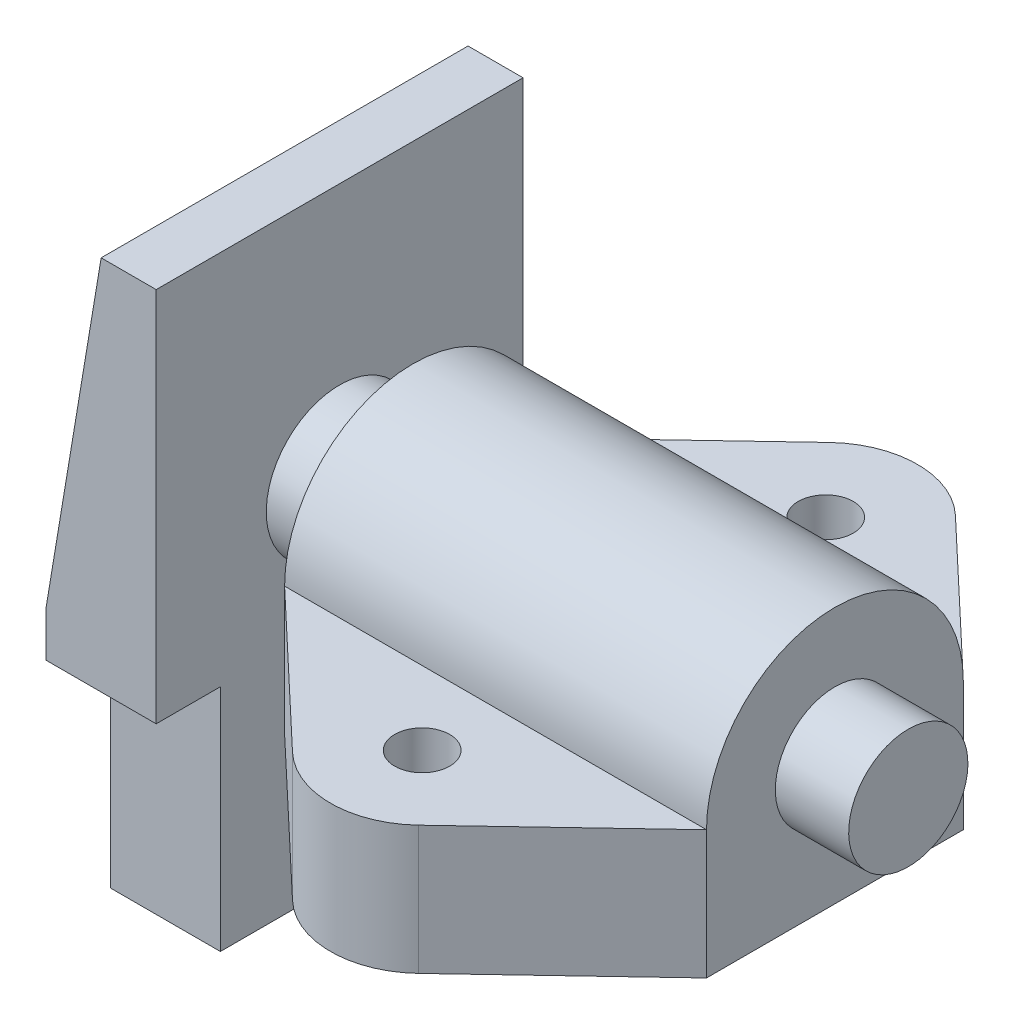
ISO-10303-21;
HEADER;
FILE_DESCRIPTION(('STEP AP214'),'2;1');
FILE_NAME('part.step','',(''),(''),'','','');
FILE_SCHEMA(('AUTOMOTIVE_DESIGN { 1 0 10303 214 1 1 1 1 }'));
ENDSEC;
DATA;
#1=APPLICATION_CONTEXT('core data for automotive mechanical design processes');
#2=APPLICATION_PROTOCOL_DEFINITION('international standard','automotive_design',2000,#1);
#3=PRODUCT_CONTEXT('',#1,'mechanical');
#4=PRODUCT('Part','Part','',(#3));
#5=PRODUCT_RELATED_PRODUCT_CATEGORY('part','',(#4));
#6=PRODUCT_DEFINITION_FORMATION('','',#4);
#7=PRODUCT_DEFINITION_CONTEXT('part definition',#1,'design');
#8=PRODUCT_DEFINITION('design','',#6,#7);
#9=PRODUCT_DEFINITION_SHAPE('','',#8);
#10=(LENGTH_UNIT() NAMED_UNIT(*) SI_UNIT(.MILLI.,.METRE.));
#11=(NAMED_UNIT(*) PLANE_ANGLE_UNIT() SI_UNIT($,.RADIAN.));
#12=(NAMED_UNIT(*) SI_UNIT($,.STERADIAN.) SOLID_ANGLE_UNIT());
#13=UNCERTAINTY_MEASURE_WITH_UNIT(LENGTH_MEASURE(1.E-05),#10,'distance_accuracy_value','');
#14=(GEOMETRIC_REPRESENTATION_CONTEXT(3) GLOBAL_UNCERTAINTY_ASSIGNED_CONTEXT((#13)) GLOBAL_UNIT_ASSIGNED_CONTEXT((#10,
#11,#12)) REPRESENTATION_CONTEXT('',''));
#15=CARTESIAN_POINT('',(0.,0.,0.));
#16=DIRECTION('',(0.,0.,1.));
#17=DIRECTION('',(1.,0.,0.));
#18=AXIS2_PLACEMENT_3D('',#15,#16,#17);
#19=CARTESIAN_POINT('',(-6.,-3.,20.));
#20=DIRECTION('',(1.,0.,0.));
#21=DIRECTION('',(0.,1.,0.));
#22=AXIS2_PLACEMENT_3D('',#19,#20,#21);
#23=PLANE('',#22);
#24=DIRECTION('',(0.,0.,-1.));
#25=VECTOR('',#24,1.);
#26=CARTESIAN_POINT('',(-6.,-8.,-13.));
#27=LINE('',#26,#25);
#28=CARTESIAN_POINT('',(-6.,-8.,-13.));
#29=VERTEX_POINT('',#28);
#30=CARTESIAN_POINT('',(-6.,-8.,-20.));
#31=VERTEX_POINT('',#30);
#32=EDGE_CURVE('E53',#29,#31,#27,.T.);
#33=ORIENTED_EDGE('',*,*,#32,.F.);
#34=DIRECTION('',(0.,-1.,0.));
#35=VECTOR('',#34,1.);
#36=CARTESIAN_POINT('',(-5.99999999999999,-33.,-13.));
#37=LINE('',#36,#35);
#38=CARTESIAN_POINT('',(-5.99999999999999,-33.,-13.));
#39=VERTEX_POINT('',#38);
#40=EDGE_CURVE('E243',#29,#39,#37,.T.);
#41=ORIENTED_EDGE('',*,*,#40,.T.);
#42=DIRECTION('',(0.,0.,-1.));
#43=VECTOR('',#42,1.);
#44=CARTESIAN_POINT('',(-5.99999999999999,-33.,20.));
#45=LINE('',#44,#43);
#46=CARTESIAN_POINT('',(-5.99999999999999,-33.,13.));
#47=VERTEX_POINT('',#46);
#48=EDGE_CURVE('E303',#47,#39,#45,.T.);
#49=ORIENTED_EDGE('',*,*,#48,.F.);
#50=DIRECTION('',(0.,-1.,0.));
#51=VECTOR('',#50,1.);
#52=CARTESIAN_POINT('',(-5.99999999999999,-33.,13.));
#53=LINE('',#52,#51);
#54=CARTESIAN_POINT('',(-6.,-8.,13.));
#55=VERTEX_POINT('',#54);
#56=EDGE_CURVE('E260',#55,#47,#53,.T.);
#57=ORIENTED_EDGE('',*,*,#56,.F.);
#58=DIRECTION('',(0.,0.,1.));
#59=VECTOR('',#58,1.);
#60=CARTESIAN_POINT('',(-6.,-8.,13.));
#61=LINE('',#60,#59);
#62=CARTESIAN_POINT('',(-6.,-8.,20.));
#63=VERTEX_POINT('',#62);
#64=EDGE_CURVE('E270',#55,#63,#61,.T.);
#65=ORIENTED_EDGE('',*,*,#64,.T.);
#66=DIRECTION('',(0.,-1.,0.));
#67=VECTOR('',#66,1.);
#68=CARTESIAN_POINT('',(-6.,-3.,20.));
#69=LINE('',#68,#67);
#70=CARTESIAN_POINT('',(-6.,-3.,20.));
#71=VERTEX_POINT('',#70);
#72=EDGE_CURVE('E278',#71,#63,#69,.T.);
#73=ORIENTED_EDGE('',*,*,#72,.F.);
#74=DIRECTION('',(0.,0.,-1.));
#75=VECTOR('',#74,1.);
#76=CARTESIAN_POINT('',(-6.,-3.,20.));
#77=LINE('',#76,#75);
#78=CARTESIAN_POINT('',(-6.,-3.,-20.));
#79=VERTEX_POINT('',#78);
#80=EDGE_CURVE('E305',#71,#79,#77,.T.);
#81=ORIENTED_EDGE('',*,*,#80,.T.);
#82=DIRECTION('',(0.,-1.,0.));
#83=VECTOR('',#82,1.);
#84=CARTESIAN_POINT('',(-6.,-3.,-20.));
#85=LINE('',#84,#83);
#86=EDGE_CURVE('E289',#79,#31,#85,.T.);
#87=ORIENTED_EDGE('',*,*,#86,.T.);
#88=EDGE_LOOP('',(#33,#41,#49,#57,#65,#73,#81,#87));
#89=FACE_BOUND('',#88,.T.);
#90=ADVANCED_FACE('F37',(#89),#23,.F.);
#91=CARTESIAN_POINT('',(6.,33.,20.));
#92=DIRECTION('',(-1.,0.,0.));
#93=DIRECTION('',(0.,-1.,0.));
#94=AXIS2_PLACEMENT_3D('',#91,#92,#93);
#95=PLANE('',#94);
#96=CARTESIAN_POINT('',(6.,6.,0.));
#97=DIRECTION('',(-1.,0.,0.));
#98=DIRECTION('',(0.,-1.,0.));
#99=AXIS2_PLACEMENT_3D('',#96,#97,#98);
#100=CIRCLE('',#99,8.);
#101=CARTESIAN_POINT('',(6.,-2.,0.));
#102=VERTEX_POINT('',#101);
#103=EDGE_CURVE('E41',#102,#102,#100,.F.);
#104=ORIENTED_EDGE('',*,*,#103,.F.);
#105=EDGE_LOOP('',(#104));
#106=FACE_BOUND('',#105,.T.);
#107=DIRECTION('',(0.,0.,-1.));
#108=VECTOR('',#107,1.);
#109=CARTESIAN_POINT('',(6.00000000000001,-8.,-13.));
#110=LINE('',#109,#108);
#111=CARTESIAN_POINT('',(6.00000000000001,-8.,-13.));
#112=VERTEX_POINT('',#111);
#113=CARTESIAN_POINT('',(6.00000000000001,-8.,-20.));
#114=VERTEX_POINT('',#113);
#115=EDGE_CURVE('E255',#112,#114,#110,.T.);
#116=ORIENTED_EDGE('',*,*,#115,.T.);
#117=DIRECTION('',(0.,1.,0.));
#118=VECTOR('',#117,1.);
#119=CARTESIAN_POINT('',(6.,33.,-20.));
#120=LINE('',#119,#118);
#121=CARTESIAN_POINT('',(6.,33.,-20.));
#122=VERTEX_POINT('',#121);
#123=EDGE_CURVE('E292',#114,#122,#120,.T.);
#124=ORIENTED_EDGE('',*,*,#123,.T.);
#125=DIRECTION('',(0.,0.,-1.));
#126=VECTOR('',#125,1.);
#127=CARTESIAN_POINT('',(6.,33.,20.));
#128=LINE('',#127,#126);
#129=CARTESIAN_POINT('',(6.,33.,20.));
#130=VERTEX_POINT('',#129);
#131=EDGE_CURVE('E297',#130,#122,#128,.T.);
#132=ORIENTED_EDGE('',*,*,#131,.F.);
#133=DIRECTION('',(0.,1.,0.));
#134=VECTOR('',#133,1.);
#135=CARTESIAN_POINT('',(6.,33.,20.));
#136=LINE('',#135,#134);
#137=CARTESIAN_POINT('',(6.,-7.99999999999999,20.));
#138=VERTEX_POINT('',#137);
#139=EDGE_CURVE('E282',#138,#130,#136,.T.);
#140=ORIENTED_EDGE('',*,*,#139,.F.);
#141=DIRECTION('',(0.,0.,1.));
#142=VECTOR('',#141,1.);
#143=CARTESIAN_POINT('',(6.00000000000001,-8.,13.));
#144=LINE('',#143,#142);
#145=CARTESIAN_POINT('',(6.00000000000001,-8.,13.));
#146=VERTEX_POINT('',#145);
#147=EDGE_CURVE('E61',#146,#138,#144,.T.);
#148=ORIENTED_EDGE('',*,*,#147,.F.);
#149=DIRECTION('',(0.,1.,0.));
#150=VECTOR('',#149,1.);
#151=CARTESIAN_POINT('',(6.00000000000001,-8.,13.));
#152=LINE('',#151,#150);
#153=CARTESIAN_POINT('',(6.00000000000001,-33.,13.));
#154=VERTEX_POINT('',#153);
#155=EDGE_CURVE('E264',#154,#146,#152,.T.);
#156=ORIENTED_EDGE('',*,*,#155,.F.);
#157=DIRECTION('',(0.,0.,-1.));
#158=VECTOR('',#157,1.);
#159=CARTESIAN_POINT('',(6.00000000000001,-33.,20.));
#160=LINE('',#159,#158);
#161=CARTESIAN_POINT('',(6.00000000000001,-33.,-13.));
#162=VERTEX_POINT('',#161);
#163=EDGE_CURVE('E300',#154,#162,#160,.T.);
#164=ORIENTED_EDGE('',*,*,#163,.T.);
#165=DIRECTION('',(0.,1.,0.));
#166=VECTOR('',#165,1.);
#167=CARTESIAN_POINT('',(6.00000000000001,-8.,-13.));
#168=LINE('',#167,#166);
#169=EDGE_CURVE('E248',#162,#112,#168,.T.);
#170=ORIENTED_EDGE('',*,*,#169,.T.);
#171=EDGE_LOOP('',(#116,#124,#132,#140,#148,#156,#164,#170));
#172=FACE_BOUND('',#171,.T.);
#173=ADVANCED_FACE('F314',(#106,#172),#95,.F.);
#174=CARTESIAN_POINT('',(0.,0.,-20.));
#175=DIRECTION('',(0.,0.,1.));
#176=DIRECTION('',(1.,0.,0.));
#177=AXIS2_PLACEMENT_3D('',#174,#175,#176);
#178=PLANE('',#177);
#179=DIRECTION('',(-1.,0.,0.));
#180=VECTOR('',#179,1.);
#181=CARTESIAN_POINT('',(-6.,-8.,-20.));
#182=LINE('',#181,#180);
#183=EDGE_CURVE('E242',#114,#31,#182,.T.);
#184=ORIENTED_EDGE('',*,*,#183,.T.);
#185=ORIENTED_EDGE('',*,*,#86,.F.);
#186=DIRECTION('',(-0.164398987305357,-0.986393923832144,0.));
#187=VECTOR('',#186,1.);
#188=CARTESIAN_POINT('',(0.,33.,-20.));
#189=LINE('',#188,#187);
#190=CARTESIAN_POINT('',(0.,33.,-20.));
#191=VERTEX_POINT('',#190);
#192=EDGE_CURVE('E273',#191,#79,#189,.T.);
#193=ORIENTED_EDGE('',*,*,#192,.F.);
#194=DIRECTION('',(-1.,0.,0.));
#195=VECTOR('',#194,1.);
#196=CARTESIAN_POINT('',(0.,33.,-20.));
#197=LINE('',#196,#195);
#198=EDGE_CURVE('E279',#122,#191,#197,.T.);
#199=ORIENTED_EDGE('',*,*,#198,.F.);
#200=ORIENTED_EDGE('',*,*,#123,.F.);
#201=EDGE_LOOP('',(#184,#185,#193,#199,#200));
#202=FACE_BOUND('',#201,.T.);
#203=ADVANCED_FACE('F317',(#202),#178,.F.);
#204=CARTESIAN_POINT('',(0.,33.,20.));
#205=DIRECTION('',(0.986393923832144,-0.164398987305357,0.));
#206=DIRECTION('',(0.164398987305357,0.986393923832144,0.));
#207=AXIS2_PLACEMENT_3D('',#204,#205,#206);
#208=PLANE('',#207);
#209=ORIENTED_EDGE('',*,*,#192,.T.);
#210=ORIENTED_EDGE('',*,*,#80,.F.);
#211=DIRECTION('',(-0.164398987305357,-0.986393923832144,0.));
#212=VECTOR('',#211,1.);
#213=CARTESIAN_POINT('',(0.,33.,20.));
#214=LINE('',#213,#212);
#215=CARTESIAN_POINT('',(0.,33.,20.));
#216=VERTEX_POINT('',#215);
#217=EDGE_CURVE('E275',#216,#71,#214,.T.);
#218=ORIENTED_EDGE('',*,*,#217,.F.);
#219=DIRECTION('',(0.,0.,-1.));
#220=VECTOR('',#219,1.);
#221=CARTESIAN_POINT('',(0.,33.,20.));
#222=LINE('',#221,#220);
#223=EDGE_CURVE('E286',#216,#191,#222,.T.);
#224=ORIENTED_EDGE('',*,*,#223,.T.);
#225=EDGE_LOOP('',(#209,#210,#218,#224));
#226=FACE_BOUND('',#225,.T.);
#227=ADVANCED_FACE('F39',(#226),#208,.F.);
#228=CARTESIAN_POINT('',(-5.99999999999999,-33.,20.));
#229=DIRECTION('',(0.,1.,0.));
#230=DIRECTION('',(0.,0.,1.));
#231=AXIS2_PLACEMENT_3D('',#228,#229,#230);
#232=PLANE('',#231);
#233=ORIENTED_EDGE('',*,*,#48,.T.);
#234=DIRECTION('',(1.,0.,0.));
#235=VECTOR('',#234,1.);
#236=CARTESIAN_POINT('',(6.00000000000001,-33.,-13.));
#237=LINE('',#236,#235);
#238=EDGE_CURVE('E251',#39,#162,#237,.T.);
#239=ORIENTED_EDGE('',*,*,#238,.T.);
#240=ORIENTED_EDGE('',*,*,#163,.F.);
#241=DIRECTION('',(1.,0.,0.));
#242=VECTOR('',#241,1.);
#243=CARTESIAN_POINT('',(6.00000000000001,-33.,13.));
#244=LINE('',#243,#242);
#245=EDGE_CURVE('E262',#47,#154,#244,.T.);
#246=ORIENTED_EDGE('',*,*,#245,.F.);
#247=EDGE_LOOP('',(#233,#239,#240,#246));
#248=FACE_BOUND('',#247,.T.);
#249=ADVANCED_FACE('F339',(#248),#232,.F.);
#250=CARTESIAN_POINT('',(0.,33.,20.));
#251=DIRECTION('',(0.,-1.,0.));
#252=DIRECTION('',(0.,0.,-1.));
#253=AXIS2_PLACEMENT_3D('',#250,#251,#252);
#254=PLANE('',#253);
#255=ORIENTED_EDGE('',*,*,#198,.T.);
#256=ORIENTED_EDGE('',*,*,#223,.F.);
#257=DIRECTION('',(-1.,0.,0.));
#258=VECTOR('',#257,1.);
#259=CARTESIAN_POINT('',(0.,33.,20.));
#260=LINE('',#259,#258);
#261=EDGE_CURVE('E284',#130,#216,#260,.T.);
#262=ORIENTED_EDGE('',*,*,#261,.F.);
#263=ORIENTED_EDGE('',*,*,#131,.T.);
#264=EDGE_LOOP('',(#255,#256,#262,#263));
#265=FACE_BOUND('',#264,.T.);
#266=ADVANCED_FACE('F327',(#265),#254,.F.);
#267=CARTESIAN_POINT('',(0.,0.,20.));
#268=DIRECTION('',(0.,0.,1.));
#269=DIRECTION('',(1.,0.,0.));
#270=AXIS2_PLACEMENT_3D('',#267,#268,#269);
#271=PLANE('',#270);
#272=DIRECTION('',(-1.,0.,0.));
#273=VECTOR('',#272,1.);
#274=CARTESIAN_POINT('',(-6.,-8.,20.));
#275=LINE('',#274,#273);
#276=EDGE_CURVE('E258',#138,#63,#275,.T.);
#277=ORIENTED_EDGE('',*,*,#276,.F.);
#278=ORIENTED_EDGE('',*,*,#139,.T.);
#279=ORIENTED_EDGE('',*,*,#261,.T.);
#280=ORIENTED_EDGE('',*,*,#217,.T.);
#281=ORIENTED_EDGE('',*,*,#72,.T.);
#282=EDGE_LOOP('',(#277,#278,#279,#280,#281));
#283=FACE_BOUND('',#282,.T.);
#284=ADVANCED_FACE('F332',(#283),#271,.T.);
#285=CARTESIAN_POINT('',(-6.,-8.,13.));
#286=DIRECTION('',(0.,1.,0.));
#287=DIRECTION('',(0.,0.,1.));
#288=AXIS2_PLACEMENT_3D('',#285,#286,#287);
#289=PLANE('',#288);
#290=ORIENTED_EDGE('',*,*,#276,.T.);
#291=ORIENTED_EDGE('',*,*,#64,.F.);
#292=DIRECTION('',(-1.,0.,0.));
#293=VECTOR('',#292,1.);
#294=CARTESIAN_POINT('',(-6.,-8.,13.));
#295=LINE('',#294,#293);
#296=EDGE_CURVE('E266',#146,#55,#295,.T.);
#297=ORIENTED_EDGE('',*,*,#296,.F.);
#298=ORIENTED_EDGE('',*,*,#147,.T.);
#299=EDGE_LOOP('',(#290,#291,#297,#298));
#300=FACE_BOUND('',#299,.T.);
#301=ADVANCED_FACE('F346',(#300),#289,.F.);
#302=CARTESIAN_POINT('',(0.,0.,13.));
#303=DIRECTION('',(0.,0.,-1.));
#304=DIRECTION('',(-1.,0.,0.));
#305=AXIS2_PLACEMENT_3D('',#302,#303,#304);
#306=PLANE('',#305);
#307=ORIENTED_EDGE('',*,*,#56,.T.);
#308=ORIENTED_EDGE('',*,*,#245,.T.);
#309=ORIENTED_EDGE('',*,*,#155,.T.);
#310=ORIENTED_EDGE('',*,*,#296,.T.);
#311=EDGE_LOOP('',(#307,#308,#309,#310));
#312=FACE_BOUND('',#311,.T.);
#313=ADVANCED_FACE('F345',(#312),#306,.F.);
#314=CARTESIAN_POINT('',(-6.,-8.,-13.));
#315=DIRECTION('',(0.,-1.,0.));
#316=DIRECTION('',(0.,0.,-1.));
#317=AXIS2_PLACEMENT_3D('',#314,#315,#316);
#318=PLANE('',#317);
#319=ORIENTED_EDGE('',*,*,#183,.F.);
#320=ORIENTED_EDGE('',*,*,#115,.F.);
#321=DIRECTION('',(-1.,0.,0.));
#322=VECTOR('',#321,1.);
#323=CARTESIAN_POINT('',(-6.,-8.,-13.));
#324=LINE('',#323,#322);
#325=EDGE_CURVE('E246',#112,#29,#324,.T.);
#326=ORIENTED_EDGE('',*,*,#325,.T.);
#327=ORIENTED_EDGE('',*,*,#32,.T.);
#328=EDGE_LOOP('',(#319,#320,#326,#327));
#329=FACE_BOUND('',#328,.T.);
#330=ADVANCED_FACE('F353',(#329),#318,.T.);
#331=CARTESIAN_POINT('',(0.,0.,-13.));
#332=DIRECTION('',(0.,0.,1.));
#333=DIRECTION('',(-1.,0.,0.));
#334=AXIS2_PLACEMENT_3D('',#331,#332,#333);
#335=PLANE('',#334);
#336=ORIENTED_EDGE('',*,*,#40,.F.);
#337=ORIENTED_EDGE('',*,*,#325,.F.);
#338=ORIENTED_EDGE('',*,*,#169,.F.);
#339=ORIENTED_EDGE('',*,*,#238,.F.);
#340=EDGE_LOOP('',(#336,#337,#338,#339));
#341=FACE_BOUND('',#340,.T.);
#342=ADVANCED_FACE('F343',(#341),#335,.F.);
#343=CARTESIAN_POINT('',(14.,6.00000000000001,0.));
#344=DIRECTION('',(-1.,0.,0.));
#345=DIRECTION('',(0.,-1.,0.));
#346=AXIS2_PLACEMENT_3D('',#343,#344,#345);
#347=CYLINDRICAL_SURFACE('',#346,8.);
#348=CARTESIAN_POINT('',(14.,6.00000000000001,0.));
#349=DIRECTION('',(1.,0.,0.));
#350=DIRECTION('',(0.,1.,0.));
#351=AXIS2_PLACEMENT_3D('',#348,#349,#350);
#352=CIRCLE('',#351,8.);
#353=CARTESIAN_POINT('',(14.,14.,0.));
#354=VERTEX_POINT('',#353);
#355=EDGE_CURVE('E239',#354,#354,#352,.T.);
#356=ORIENTED_EDGE('',*,*,#355,.F.);
#357=EDGE_LOOP('',(#356));
#358=FACE_BOUND('',#357,.T.);
#359=ORIENTED_EDGE('',*,*,#103,.T.);
#360=EDGE_LOOP('',(#359));
#361=FACE_BOUND('',#360,.T.);
#362=ADVANCED_FACE('F312',(#358,#361),#347,.T.);
#363=CARTESIAN_POINT('',(60.,6.00000000000001,0.));
#364=DIRECTION('',(-1.,0.,0.));
#365=DIRECTION('',(0.,-1.,0.));
#366=AXIS2_PLACEMENT_3D('',#363,#364,#365);
#367=CYLINDRICAL_SURFACE('',#366,14.);
#368=CARTESIAN_POINT('',(14.,6.00000000000001,0.));
#369=DIRECTION('',(1.,0.,0.));
#370=DIRECTION('',(0.,1.,0.));
#371=AXIS2_PLACEMENT_3D('',#368,#369,#370);
#372=CIRCLE('',#371,14.);
#373=CARTESIAN_POINT('',(14.,6.,-14.));
#374=VERTEX_POINT('',#373);
#375=CARTESIAN_POINT('',(14.,6.00000000000001,14.));
#376=VERTEX_POINT('',#375);
#377=EDGE_CURVE('E214',#374,#376,#372,.T.);
#378=ORIENTED_EDGE('',*,*,#377,.T.);
#379=DIRECTION('',(-1.,0.,0.));
#380=VECTOR('',#379,1.);
#381=CARTESIAN_POINT('',(60.,6.00000000000001,14.));
#382=LINE('',#381,#380);
#383=CARTESIAN_POINT('',(60.,6.00000000000001,14.));
#384=VERTEX_POINT('',#383);
#385=EDGE_CURVE('E236',#384,#376,#382,.T.);
#386=ORIENTED_EDGE('',*,*,#385,.F.);
#387=CARTESIAN_POINT('',(60.,6.00000000000001,0.));
#388=DIRECTION('',(1.,0.,0.));
#389=DIRECTION('',(0.,1.,0.));
#390=AXIS2_PLACEMENT_3D('',#387,#388,#389);
#391=CIRCLE('',#390,14.);
#392=CARTESIAN_POINT('',(60.,6.00000000000001,-14.));
#393=VERTEX_POINT('',#392);
#394=EDGE_CURVE('E216',#393,#384,#391,.T.);
#395=ORIENTED_EDGE('',*,*,#394,.F.);
#396=DIRECTION('',(-1.,0.,0.));
#397=VECTOR('',#396,1.);
#398=CARTESIAN_POINT('',(60.,6.00000000000001,-14.));
#399=LINE('',#398,#397);
#400=EDGE_CURVE('E224',#393,#374,#399,.T.);
#401=ORIENTED_EDGE('',*,*,#400,.T.);
#402=EDGE_LOOP('',(#378,#386,#395,#401));
#403=FACE_BOUND('',#402,.T.);
#404=ADVANCED_FACE('F430',(#403),#367,.T.);
#405=CARTESIAN_POINT('',(60.,-7.99999999999999,14.));
#406=DIRECTION('',(0.,1.,0.));
#407=DIRECTION('',(-1.,0.,0.));
#408=AXIS2_PLACEMENT_3D('',#405,#406,#407);
#409=PLANE('',#408);
#410=CARTESIAN_POINT('',(37.,-7.99999999999999,-22.));
#411=DIRECTION('',(0.,1.,0.));
#412=DIRECTION('',(-1.,0.,0.));
#413=AXIS2_PLACEMENT_3D('',#410,#411,#412);
#414=CIRCLE('',#413,3.);
#415=CARTESIAN_POINT('',(34.,-7.99999999999999,-22.));
#416=VERTEX_POINT('',#415);
#417=EDGE_CURVE('E650',#416,#416,#414,.F.);
#418=ORIENTED_EDGE('',*,*,#417,.F.);
#419=EDGE_LOOP('',(#418));
#420=FACE_BOUND('',#419,.T.);
#421=CARTESIAN_POINT('',(37.,-7.99999999999999,22.));
#422=DIRECTION('',(0.,1.,0.));
#423=DIRECTION('',(-1.,0.,0.));
#424=AXIS2_PLACEMENT_3D('',#421,#422,#423);
#425=CIRCLE('',#424,3.);
#426=CARTESIAN_POINT('',(34.,-7.99999999999999,22.));
#427=VERTEX_POINT('',#426);
#428=EDGE_CURVE('E654',#427,#427,#425,.T.);
#429=ORIENTED_EDGE('',*,*,#428,.T.);
#430=EDGE_LOOP('',(#429));
#431=FACE_BOUND('',#430,.T.);
#432=DIRECTION('',(0.,0.,-1.));
#433=VECTOR('',#432,1.);
#434=CARTESIAN_POINT('',(14.,-7.99999999999999,14.));
#435=LINE('',#434,#433);
#436=CARTESIAN_POINT('',(14.,-8.,14.));
#437=VERTEX_POINT('',#436);
#438=CARTESIAN_POINT('',(14.,-7.99999999999999,-14.));
#439=VERTEX_POINT('',#438);
#440=EDGE_CURVE('E230',#437,#439,#435,.T.);
#441=ORIENTED_EDGE('',*,*,#440,.T.);
#442=DIRECTION('',(0.726278037364273,0.,-0.68740105647453));
#443=VECTOR('',#442,1.);
#444=CARTESIAN_POINT('',(14.,-8.,-14.));
#445=LINE('',#444,#443);
#446=CARTESIAN_POINT('',(30.1259894352547,-8.,-29.2627803736427));
#447=VERTEX_POINT('',#446);
#448=EDGE_CURVE('E166',#439,#447,#445,.T.);
#449=ORIENTED_EDGE('',*,*,#448,.T.);
#450=CARTESIAN_POINT('',(37.,-8.,-22.));
#451=DIRECTION('',(0.,-1.,0.));
#452=DIRECTION('',(0.,0.,-1.));
#453=AXIS2_PLACEMENT_3D('',#450,#451,#452);
#454=CIRCLE('',#453,10.);
#455=CARTESIAN_POINT('',(43.8740105647453,-8.,-29.2627803736427));
#456=VERTEX_POINT('',#455);
#457=EDGE_CURVE('E158',#447,#456,#454,.T.);
#458=ORIENTED_EDGE('',*,*,#457,.T.);
#459=DIRECTION('',(0.726278037364273,0.,0.68740105647453));
#460=VECTOR('',#459,1.);
#461=CARTESIAN_POINT('',(60.,-8.,-14.));
#462=LINE('',#461,#460);
#463=CARTESIAN_POINT('',(60.,-7.99999999999999,-14.));
#464=VERTEX_POINT('',#463);
#465=EDGE_CURVE('E163',#456,#464,#462,.T.);
#466=ORIENTED_EDGE('',*,*,#465,.T.);
#467=DIRECTION('',(0.,0.,-1.));
#468=VECTOR('',#467,1.);
#469=CARTESIAN_POINT('',(60.,-7.99999999999999,14.));
#470=LINE('',#469,#468);
#471=CARTESIAN_POINT('',(60.,-7.99999999999999,14.));
#472=VERTEX_POINT('',#471);
#473=EDGE_CURVE('E221',#472,#464,#470,.T.);
#474=ORIENTED_EDGE('',*,*,#473,.F.);
#475=DIRECTION('',(0.726278037364273,0.,-0.68740105647453));
#476=VECTOR('',#475,1.);
#477=CARTESIAN_POINT('',(60.,-8.,14.));
#478=LINE('',#477,#476);
#479=CARTESIAN_POINT('',(43.8740105647453,-8.,29.2627803736427));
#480=VERTEX_POINT('',#479);
#481=EDGE_CURVE('E201',#480,#472,#478,.T.);
#482=ORIENTED_EDGE('',*,*,#481,.F.);
#483=CARTESIAN_POINT('',(37.,-8.,22.));
#484=DIRECTION('',(0.,1.,0.));
#485=DIRECTION('',(0.,0.,1.));
#486=AXIS2_PLACEMENT_3D('',#483,#484,#485);
#487=CIRCLE('',#486,10.);
#488=CARTESIAN_POINT('',(30.1259894352547,-8.,29.2627803736427));
#489=VERTEX_POINT('',#488);
#490=EDGE_CURVE('E197',#489,#480,#487,.T.);
#491=ORIENTED_EDGE('',*,*,#490,.F.);
#492=DIRECTION('',(0.726278037364273,0.,0.68740105647453));
#493=VECTOR('',#492,1.);
#494=CARTESIAN_POINT('',(14.,-8.,14.));
#495=LINE('',#494,#493);
#496=EDGE_CURVE('E194',#437,#489,#495,.T.);
#497=ORIENTED_EDGE('',*,*,#496,.F.);
#498=EDGE_LOOP('',(#441,#449,#458,#466,#474,#482,#491,#497));
#499=FACE_BOUND('',#498,.T.);
#500=ADVANCED_FACE('F160',(#420,#431,#499),#409,.F.);
#501=CARTESIAN_POINT('',(60.,6.00000000000001,0.));
#502=DIRECTION('',(1.,0.,0.));
#503=DIRECTION('',(0.,1.,0.));
#504=AXIS2_PLACEMENT_3D('',#501,#502,#503);
#505=PLANE('',#504);
#506=CARTESIAN_POINT('',(60.,6.00000000000001,0.));
#507=DIRECTION('',(1.,0.,0.));
#508=DIRECTION('',(0.,1.,0.));
#509=AXIS2_PLACEMENT_3D('',#506,#507,#508);
#510=CIRCLE('',#509,6.5);
#511=CARTESIAN_POINT('',(60.,12.5,0.));
#512=VERTEX_POINT('',#511);
#513=EDGE_CURVE('E11',#512,#512,#510,.T.);
#514=ORIENTED_EDGE('',*,*,#513,.F.);
#515=EDGE_LOOP('',(#514));
#516=FACE_BOUND('',#515,.T.);
#517=ORIENTED_EDGE('',*,*,#394,.T.);
#518=DIRECTION('',(0.,-1.,0.));
#519=VECTOR('',#518,1.);
#520=CARTESIAN_POINT('',(60.,6.00000000000001,14.));
#521=LINE('',#520,#519);
#522=EDGE_CURVE('E218',#384,#472,#521,.T.);
#523=ORIENTED_EDGE('',*,*,#522,.T.);
#524=ORIENTED_EDGE('',*,*,#473,.T.);
#525=DIRECTION('',(0.,1.,0.));
#526=VECTOR('',#525,1.);
#527=CARTESIAN_POINT('',(60.,-7.99999999999999,-14.));
#528=LINE('',#527,#526);
#529=EDGE_CURVE('E181',#464,#393,#528,.T.);
#530=ORIENTED_EDGE('',*,*,#529,.T.);
#531=EDGE_LOOP('',(#517,#523,#524,#530));
#532=FACE_BOUND('',#531,.T.);
#533=ADVANCED_FACE('F486',(#516,#532),#505,.T.);
#534=CARTESIAN_POINT('',(14.,6.00000000000001,0.));
#535=DIRECTION('',(1.,0.,0.));
#536=DIRECTION('',(0.,1.,0.));
#537=AXIS2_PLACEMENT_3D('',#534,#535,#536);
#538=PLANE('',#537);
#539=ORIENTED_EDGE('',*,*,#355,.T.);
#540=EDGE_LOOP('',(#539));
#541=FACE_BOUND('',#540,.T.);
#542=ORIENTED_EDGE('',*,*,#377,.F.);
#543=DIRECTION('',(0.,1.,0.));
#544=VECTOR('',#543,1.);
#545=CARTESIAN_POINT('',(14.,-7.99999999999999,-14.));
#546=LINE('',#545,#544);
#547=EDGE_CURVE('E219',#439,#374,#546,.T.);
#548=ORIENTED_EDGE('',*,*,#547,.F.);
#549=ORIENTED_EDGE('',*,*,#440,.F.);
#550=DIRECTION('',(0.,-1.,0.));
#551=VECTOR('',#550,1.);
#552=CARTESIAN_POINT('',(14.,6.00000000000001,14.));
#553=LINE('',#552,#551);
#554=EDGE_CURVE('E227',#376,#437,#553,.T.);
#555=ORIENTED_EDGE('',*,*,#554,.F.);
#556=EDGE_LOOP('',(#542,#548,#549,#555));
#557=FACE_BOUND('',#556,.T.);
#558=ADVANCED_FACE('F445',(#541,#557),#538,.F.);
#559=CARTESIAN_POINT('',(14.,-8.,14.));
#560=DIRECTION('',(-0.68740105647453,0.,0.726278037364273));
#561=DIRECTION('',(0.726278037364273,0.,0.68740105647453));
#562=AXIS2_PLACEMENT_3D('',#559,#560,#561);
#563=PLANE('',#562);
#564=DIRECTION('',(0.726278037364273,0.,0.68740105647453));
#565=VECTOR('',#564,1.);
#566=CARTESIAN_POINT('',(14.,6.,14.));
#567=LINE('',#566,#565);
#568=CARTESIAN_POINT('',(30.1259894352547,6.,29.2627803736427));
#569=VERTEX_POINT('',#568);
#570=EDGE_CURVE('E192',#376,#569,#567,.T.);
#571=ORIENTED_EDGE('',*,*,#570,.F.);
#572=ORIENTED_EDGE('',*,*,#554,.T.);
#573=ORIENTED_EDGE('',*,*,#496,.T.);
#574=DIRECTION('',(0.,1.,0.));
#575=VECTOR('',#574,1.);
#576=CARTESIAN_POINT('',(30.1259894352547,-8.,29.2627803736427));
#577=LINE('',#576,#575);
#578=EDGE_CURVE('E204',#489,#569,#577,.T.);
#579=ORIENTED_EDGE('',*,*,#578,.T.);
#580=EDGE_LOOP('',(#571,#572,#573,#579));
#581=FACE_BOUND('',#580,.T.);
#582=ADVANCED_FACE('F439',(#581),#563,.T.);
#583=CARTESIAN_POINT('',(60.,-8.,14.));
#584=DIRECTION('',(0.68740105647453,0.,0.726278037364273));
#585=DIRECTION('',(0.726278037364273,0.,-0.68740105647453));
#586=AXIS2_PLACEMENT_3D('',#583,#584,#585);
#587=PLANE('',#586);
#588=DIRECTION('',(0.726278037364273,0.,-0.68740105647453));
#589=VECTOR('',#588,1.);
#590=CARTESIAN_POINT('',(60.,6.,14.));
#591=LINE('',#590,#589);
#592=CARTESIAN_POINT('',(43.8740105647453,6.,29.2627803736427));
#593=VERTEX_POINT('',#592);
#594=EDGE_CURVE('E198',#593,#384,#591,.T.);
#595=ORIENTED_EDGE('',*,*,#594,.F.);
#596=DIRECTION('',(0.,1.,0.));
#597=VECTOR('',#596,1.);
#598=CARTESIAN_POINT('',(43.8740105647453,-8.,29.2627803736427));
#599=LINE('',#598,#597);
#600=EDGE_CURVE('E212',#480,#593,#599,.T.);
#601=ORIENTED_EDGE('',*,*,#600,.F.);
#602=ORIENTED_EDGE('',*,*,#481,.T.);
#603=ORIENTED_EDGE('',*,*,#522,.F.);
#604=EDGE_LOOP('',(#595,#601,#602,#603));
#605=FACE_BOUND('',#604,.T.);
#606=ADVANCED_FACE('F444',(#605),#587,.T.);
#607=CARTESIAN_POINT('',(37.,-8.,22.));
#608=DIRECTION('',(0.,1.,0.));
#609=DIRECTION('',(0.,0.,1.));
#610=AXIS2_PLACEMENT_3D('',#607,#608,#609);
#611=CYLINDRICAL_SURFACE('',#610,10.);
#612=CARTESIAN_POINT('',(37.,6.,22.));
#613=DIRECTION('',(0.,1.,0.));
#614=DIRECTION('',(0.,0.,1.));
#615=AXIS2_PLACEMENT_3D('',#612,#613,#614);
#616=CIRCLE('',#615,10.);
#617=EDGE_CURVE('E207',#569,#593,#616,.T.);
#618=ORIENTED_EDGE('',*,*,#617,.F.);
#619=ORIENTED_EDGE('',*,*,#578,.F.);
#620=ORIENTED_EDGE('',*,*,#490,.T.);
#621=ORIENTED_EDGE('',*,*,#600,.T.);
#622=EDGE_LOOP('',(#618,#619,#620,#621));
#623=FACE_BOUND('',#622,.T.);
#624=ADVANCED_FACE('F458',(#623),#611,.T.);
#625=CARTESIAN_POINT('',(37.,6.,22.));
#626=DIRECTION('',(0.,1.,0.));
#627=DIRECTION('',(0.,0.,1.));
#628=AXIS2_PLACEMENT_3D('',#625,#626,#627);
#629=PLANE('',#628);
#630=CARTESIAN_POINT('',(37.,6.,22.));
#631=DIRECTION('',(0.,1.,0.));
#632=DIRECTION('',(0.,0.,1.));
#633=AXIS2_PLACEMENT_3D('',#630,#631,#632);
#634=CIRCLE('',#633,3.);
#635=CARTESIAN_POINT('',(37.,6.,25.));
#636=VERTEX_POINT('',#635);
#637=EDGE_CURVE('E651',#636,#636,#634,.T.);
#638=ORIENTED_EDGE('',*,*,#637,.F.);
#639=EDGE_LOOP('',(#638));
#640=FACE_BOUND('',#639,.T.);
#641=ORIENTED_EDGE('',*,*,#570,.T.);
#642=ORIENTED_EDGE('',*,*,#617,.T.);
#643=ORIENTED_EDGE('',*,*,#594,.T.);
#644=ORIENTED_EDGE('',*,*,#385,.T.);
#645=EDGE_LOOP('',(#641,#642,#643,#644));
#646=FACE_BOUND('',#645,.T.);
#647=ADVANCED_FACE('F469',(#640,#646),#629,.T.);
#648=CARTESIAN_POINT('',(14.,-8.,-14.));
#649=DIRECTION('',(0.68740105647453,0.,0.726278037364273));
#650=DIRECTION('',(0.726278037364273,0.,-0.68740105647453));
#651=AXIS2_PLACEMENT_3D('',#648,#649,#650);
#652=PLANE('',#651);
#653=DIRECTION('',(0.726278037364273,0.,-0.68740105647453));
#654=VECTOR('',#653,1.);
#655=CARTESIAN_POINT('',(14.,6.,-14.));
#656=LINE('',#655,#654);
#657=CARTESIAN_POINT('',(30.1259894352547,6.,-29.2627803736427));
#658=VERTEX_POINT('',#657);
#659=EDGE_CURVE('E185',#374,#658,#656,.T.);
#660=ORIENTED_EDGE('',*,*,#659,.T.);
#661=DIRECTION('',(0.,1.,0.));
#662=VECTOR('',#661,1.);
#663=CARTESIAN_POINT('',(30.1259894352547,-8.,-29.2627803736427));
#664=LINE('',#663,#662);
#665=EDGE_CURVE('E178',#447,#658,#664,.T.);
#666=ORIENTED_EDGE('',*,*,#665,.F.);
#667=ORIENTED_EDGE('',*,*,#448,.F.);
#668=ORIENTED_EDGE('',*,*,#547,.T.);
#669=EDGE_LOOP('',(#660,#666,#667,#668));
#670=FACE_BOUND('',#669,.T.);
#671=ADVANCED_FACE('F491',(#670),#652,.F.);
#672=CARTESIAN_POINT('',(37.,-8.,-22.));
#673=DIRECTION('',(0.,1.,0.));
#674=DIRECTION('',(0.,0.,1.));
#675=AXIS2_PLACEMENT_3D('',#672,#673,#674);
#676=CYLINDRICAL_SURFACE('',#675,10.);
#677=CARTESIAN_POINT('',(37.,6.,-22.));
#678=DIRECTION('',(0.,-1.,0.));
#679=DIRECTION('',(0.,0.,-1.));
#680=AXIS2_PLACEMENT_3D('',#677,#678,#679);
#681=CIRCLE('',#680,10.);
#682=CARTESIAN_POINT('',(43.8740105647453,6.,-29.2627803736427));
#683=VERTEX_POINT('',#682);
#684=EDGE_CURVE('E174',#658,#683,#681,.T.);
#685=ORIENTED_EDGE('',*,*,#684,.T.);
#686=DIRECTION('',(0.,1.,0.));
#687=VECTOR('',#686,1.);
#688=CARTESIAN_POINT('',(43.8740105647453,-8.,-29.2627803736427));
#689=LINE('',#688,#687);
#690=EDGE_CURVE('E170',#456,#683,#689,.T.);
#691=ORIENTED_EDGE('',*,*,#690,.F.);
#692=ORIENTED_EDGE('',*,*,#457,.F.);
#693=ORIENTED_EDGE('',*,*,#665,.T.);
#694=EDGE_LOOP('',(#685,#691,#692,#693));
#695=FACE_BOUND('',#694,.T.);
#696=ADVANCED_FACE('F173',(#695),#676,.T.);
#697=CARTESIAN_POINT('',(60.,-8.,-14.));
#698=DIRECTION('',(-0.68740105647453,0.,0.726278037364273));
#699=DIRECTION('',(0.726278037364273,0.,0.68740105647453));
#700=AXIS2_PLACEMENT_3D('',#697,#698,#699);
#701=PLANE('',#700);
#702=DIRECTION('',(0.726278037364273,0.,0.68740105647453));
#703=VECTOR('',#702,1.);
#704=CARTESIAN_POINT('',(60.,6.,-14.));
#705=LINE('',#704,#703);
#706=EDGE_CURVE('E188',#683,#393,#705,.T.);
#707=ORIENTED_EDGE('',*,*,#706,.T.);
#708=ORIENTED_EDGE('',*,*,#529,.F.);
#709=ORIENTED_EDGE('',*,*,#465,.F.);
#710=ORIENTED_EDGE('',*,*,#690,.T.);
#711=EDGE_LOOP('',(#707,#708,#709,#710));
#712=FACE_BOUND('',#711,.T.);
#713=ADVANCED_FACE('F180',(#712),#701,.F.);
#714=CARTESIAN_POINT('',(37.,6.,-22.));
#715=DIRECTION('',(0.,1.,0.));
#716=DIRECTION('',(0.,0.,-1.));
#717=AXIS2_PLACEMENT_3D('',#714,#715,#716);
#718=PLANE('',#717);
#719=CARTESIAN_POINT('',(37.,6.,-22.));
#720=DIRECTION('',(0.,-1.,0.));
#721=DIRECTION('',(0.,0.,-1.));
#722=AXIS2_PLACEMENT_3D('',#719,#720,#721);
#723=CIRCLE('',#722,3.);
#724=CARTESIAN_POINT('',(37.,6.,-25.));
#725=VERTEX_POINT('',#724);
#726=EDGE_CURVE('E647',#725,#725,#723,.T.);
#727=ORIENTED_EDGE('',*,*,#726,.T.);
#728=EDGE_LOOP('',(#727));
#729=FACE_BOUND('',#728,.T.);
#730=ORIENTED_EDGE('',*,*,#659,.F.);
#731=ORIENTED_EDGE('',*,*,#400,.F.);
#732=ORIENTED_EDGE('',*,*,#706,.F.);
#733=ORIENTED_EDGE('',*,*,#684,.F.);
#734=EDGE_LOOP('',(#730,#731,#732,#733));
#735=FACE_BOUND('',#734,.T.);
#736=ADVANCED_FACE('F517',(#729,#735),#718,.T.);
#737=CARTESIAN_POINT('',(68.,6.00000000000001,0.));
#738=DIRECTION('',(-1.,0.,0.));
#739=DIRECTION('',(0.,-1.,0.));
#740=AXIS2_PLACEMENT_3D('',#737,#738,#739);
#741=CYLINDRICAL_SURFACE('',#740,6.5);
#742=CARTESIAN_POINT('',(68.,6.00000000000001,0.));
#743=DIRECTION('',(1.,0.,0.));
#744=DIRECTION('',(0.,1.,0.));
#745=AXIS2_PLACEMENT_3D('',#742,#743,#744);
#746=CIRCLE('',#745,6.5);
#747=CARTESIAN_POINT('',(68.,12.5,0.));
#748=VERTEX_POINT('',#747);
#749=EDGE_CURVE('E189',#748,#748,#746,.T.);
#750=ORIENTED_EDGE('',*,*,#749,.F.);
#751=EDGE_LOOP('',(#750));
#752=FACE_BOUND('',#751,.T.);
#753=ORIENTED_EDGE('',*,*,#513,.T.);
#754=EDGE_LOOP('',(#753));
#755=FACE_BOUND('',#754,.T.);
#756=ADVANCED_FACE('F531',(#752,#755),#741,.T.);
#757=CARTESIAN_POINT('',(68.,6.00000000000001,0.));
#758=DIRECTION('',(1.,0.,0.));
#759=DIRECTION('',(0.,1.,0.));
#760=AXIS2_PLACEMENT_3D('',#757,#758,#759);
#761=PLANE('',#760);
#762=ORIENTED_EDGE('',*,*,#749,.T.);
#763=EDGE_LOOP('',(#762));
#764=FACE_BOUND('',#763,.T.);
#765=ADVANCED_FACE('F536',(#764),#761,.T.);
#766=CARTESIAN_POINT('',(37.,-33.,22.));
#767=DIRECTION('',(0.,1.,0.));
#768=DIRECTION('',(0.,0.,1.));
#769=AXIS2_PLACEMENT_3D('',#766,#767,#768);
#770=CYLINDRICAL_SURFACE('',#769,3.);
#771=ORIENTED_EDGE('',*,*,#637,.T.);
#772=EDGE_LOOP('',(#771));
#773=FACE_BOUND('',#772,.T.);
#774=ORIENTED_EDGE('',*,*,#428,.F.);
#775=EDGE_LOOP('',(#774));
#776=FACE_BOUND('',#775,.T.);
#777=ADVANCED_FACE('F547',(#773,#776),#770,.F.);
#778=CARTESIAN_POINT('',(37.,-33.,-22.));
#779=DIRECTION('',(0.,1.,0.));
#780=DIRECTION('',(0.,0.,1.));
#781=AXIS2_PLACEMENT_3D('',#778,#779,#780);
#782=CYLINDRICAL_SURFACE('',#781,3.);
#783=ORIENTED_EDGE('',*,*,#726,.F.);
#784=EDGE_LOOP('',(#783));
#785=FACE_BOUND('',#784,.T.);
#786=ORIENTED_EDGE('',*,*,#417,.T.);
#787=EDGE_LOOP('',(#786));
#788=FACE_BOUND('',#787,.T.);
#789=ADVANCED_FACE('F563',(#785,#788),#782,.F.);
#790=CLOSED_SHELL('',(#90,#173,#203,#227,#249,#266,#284,#301,#313,#330,#342,#362,#404,#500,#533,
#558,#582,#606,#624,#647,#671,#696,#713,#736,#756,#765,#777,#789));
#791=MANIFOLD_SOLID_BREP('B2',#790);
#792=ADVANCED_BREP_SHAPE_REPRESENTATION('',(#18,#791),#14);
#793=SHAPE_DEFINITION_REPRESENTATION(#9,#792);
ENDSEC;
END-ISO-10303-21;
